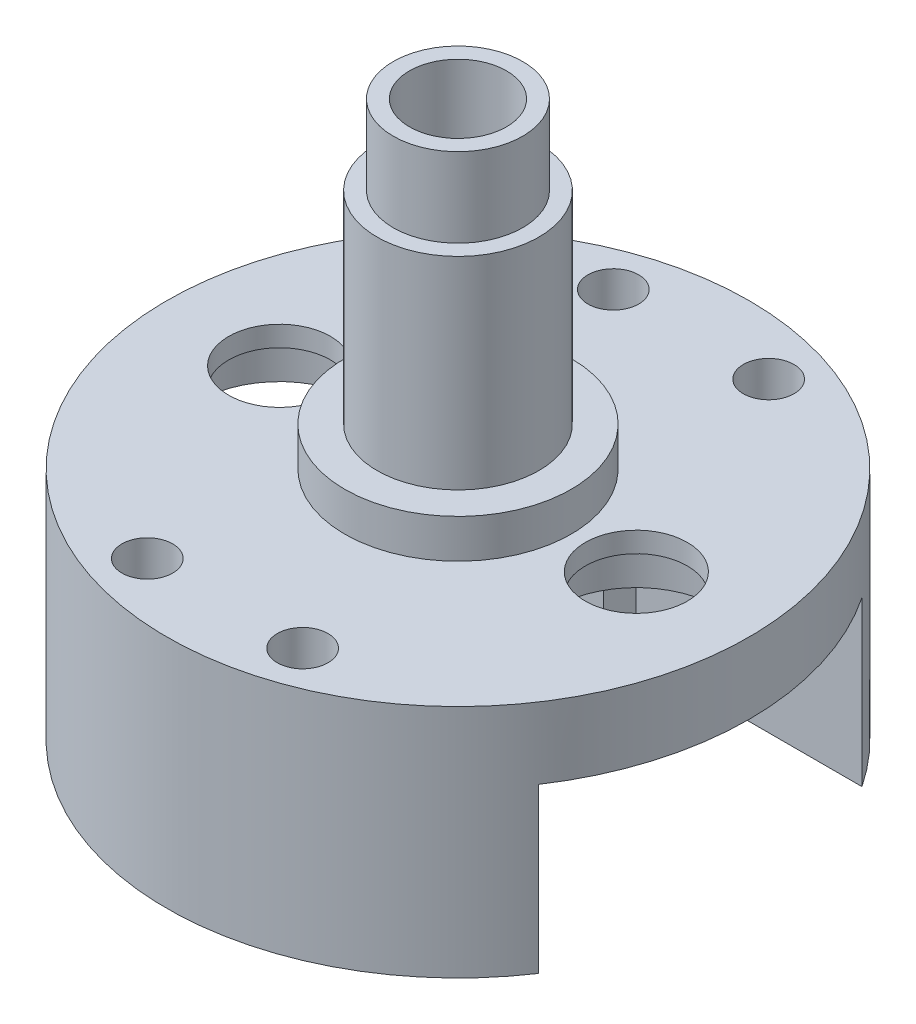
ISO-10303-21;
HEADER;
FILE_DESCRIPTION(('STEP AP214'),'2;1');
FILE_NAME('part.step','',(''),(''),'','','');
FILE_SCHEMA(('AUTOMOTIVE_DESIGN { 1 0 10303 214 1 1 1 1 }'));
ENDSEC;
DATA;
#1=APPLICATION_CONTEXT('core data for automotive mechanical design processes');
#2=APPLICATION_PROTOCOL_DEFINITION('international standard','automotive_design',2000,#1);
#3=PRODUCT_CONTEXT('',#1,'mechanical');
#4=PRODUCT('Part','Part','',(#3));
#5=PRODUCT_RELATED_PRODUCT_CATEGORY('part','',(#4));
#6=PRODUCT_DEFINITION_FORMATION('','',#4);
#7=PRODUCT_DEFINITION_CONTEXT('part definition',#1,'design');
#8=PRODUCT_DEFINITION('design','',#6,#7);
#9=PRODUCT_DEFINITION_SHAPE('','',#8);
#10=(LENGTH_UNIT() NAMED_UNIT(*) SI_UNIT(.MILLI.,.METRE.));
#11=(NAMED_UNIT(*) PLANE_ANGLE_UNIT() SI_UNIT($,.RADIAN.));
#12=(NAMED_UNIT(*) SI_UNIT($,.STERADIAN.) SOLID_ANGLE_UNIT());
#13=UNCERTAINTY_MEASURE_WITH_UNIT(LENGTH_MEASURE(1.E-05),#10,'distance_accuracy_value','');
#14=(GEOMETRIC_REPRESENTATION_CONTEXT(3) GLOBAL_UNCERTAINTY_ASSIGNED_CONTEXT((#13)) GLOBAL_UNIT_ASSIGNED_CONTEXT((#10,
#11,#12)) REPRESENTATION_CONTEXT('',''));
#15=CARTESIAN_POINT('',(0.,0.,0.));
#16=DIRECTION('',(0.,0.,1.));
#17=DIRECTION('',(1.,0.,0.));
#18=AXIS2_PLACEMENT_3D('',#15,#16,#17);
#19=CARTESIAN_POINT('',(0.,23.65375,0.));
#20=DIRECTION('',(0.,1.,0.));
#21=DIRECTION('',(0.,0.,1.));
#22=AXIS2_PLACEMENT_3D('',#19,#20,#21);
#23=PLANE('',#22);
#24=CARTESIAN_POINT('',(0.,23.65375,0.));
#25=DIRECTION('',(0.,1.,0.));
#26=DIRECTION('',(0.,0.,1.));
#27=AXIS2_PLACEMENT_3D('',#24,#25,#26);
#28=CIRCLE('',#27,7.9375);
#29=CARTESIAN_POINT('',(0.,23.65375,-7.9375));
#30=VERTEX_POINT('',#29);
#31=EDGE_CURVE('E272',#30,#30,#28,.T.);
#32=ORIENTED_EDGE('',*,*,#31,.T.);
#33=EDGE_LOOP('',(#32));
#34=FACE_BOUND('',#33,.T.);
#35=CARTESIAN_POINT('',(0.,23.65375,0.));
#36=DIRECTION('',(0.,1.,0.));
#37=DIRECTION('',(0.,0.,1.));
#38=AXIS2_PLACEMENT_3D('',#35,#36,#37);
#39=CIRCLE('',#38,6.35);
#40=CARTESIAN_POINT('',(0.,23.65375,6.35));
#41=VERTEX_POINT('',#40);
#42=EDGE_CURVE('E577',#41,#41,#39,.T.);
#43=ORIENTED_EDGE('',*,*,#42,.F.);
#44=EDGE_LOOP('',(#43));
#45=FACE_BOUND('',#44,.T.);
#46=ADVANCED_FACE('F41',(#34,#45),#23,.T.);
#47=CARTESIAN_POINT('',(0.,-7.,0.));
#48=DIRECTION('',(0.,1.,0.));
#49=DIRECTION('',(0.,0.,1.));
#50=AXIS2_PLACEMENT_3D('',#47,#48,#49);
#51=CYLINDRICAL_SURFACE('',#50,28.575);
#52=CARTESIAN_POINT('',(0.,0.,0.));
#53=DIRECTION('',(0.,-1.,0.));
#54=DIRECTION('',(0.,0.,-1.));
#55=AXIS2_PLACEMENT_3D('',#52,#53,#54);
#56=CIRCLE('',#55,28.575);
#57=CARTESIAN_POINT('',(0.,0.,-28.575));
#58=VERTEX_POINT('',#57);
#59=EDGE_CURVE('E301',#58,#58,#56,.T.);
#60=ORIENTED_EDGE('',*,*,#59,.T.);
#61=EDGE_LOOP('',(#60));
#62=FACE_BOUND('',#61,.T.);
#63=CARTESIAN_POINT('',(0.,-23.063999876,0.));
#64=DIRECTION('',(0.,-1.,0.));
#65=DIRECTION('',(0.,0.,-1.));
#66=AXIS2_PLACEMENT_3D('',#63,#64,#65);
#67=CIRCLE('',#66,28.575);
#68=CARTESIAN_POINT('',(1.5875,-23.063999876,-28.5308686995331));
#69=VERTEX_POINT('',#68);
#70=CARTESIAN_POINT('',(23.7595244060145,-23.063999876,-15.875));
#71=VERTEX_POINT('',#70);
#72=EDGE_CURVE('E316',#69,#71,#67,.T.);
#73=ORIENTED_EDGE('',*,*,#72,.F.);
#74=DIRECTION('',(0.,1.,0.));
#75=VECTOR('',#74,1.);
#76=CARTESIAN_POINT('',(1.5875,-7.,-28.5308686995331));
#77=LINE('',#76,#75);
#78=CARTESIAN_POINT('',(1.5875,-8.5875,-28.5308686995331));
#79=VERTEX_POINT('',#78);
#80=EDGE_CURVE('E145',#69,#79,#77,.T.);
#81=ORIENTED_EDGE('',*,*,#80,.T.);
#82=CARTESIAN_POINT('',(1.5875,-8.5875,-28.5308686995331));
#83=CARTESIAN_POINT('',(1.58749974451946,-8.54287386097159,-28.5308681095562));
#84=CARTESIAN_POINT('',(1.58561709384864,-8.49826913552358,-28.5309735349975));
#85=CARTESIAN_POINT('',(1.57810670264764,-8.40937952397936,-28.5313901712426));
#86=CARTESIAN_POINT('',(1.57247916280447,-8.36509462087254,-28.531701371019));
#87=CARTESIAN_POINT('',(1.55003331279288,-8.23327392438512,-28.5329329180939));
#88=CARTESIAN_POINT('',(1.52765162069218,-8.14662221965412,-28.5341512536931));
#89=CARTESIAN_POINT('',(1.4686791099605,-7.97831722788696,-28.5372470307653));
#90=CARTESIAN_POINT('',(1.43208208220718,-7.89666614314049,-28.5391247602207));
#91=CARTESIAN_POINT('',(1.34572456158475,-7.74066833680871,-28.5433269249275));
#92=CARTESIAN_POINT('',(1.29596634545697,-7.66632035491434,-28.5456512828981));
#93=CARTESIAN_POINT('',(1.18463872995349,-7.52695729549172,-28.5504878023659));
#94=CARTESIAN_POINT('',(1.12305776151971,-7.46195146950919,-28.5530001463337));
#95=CARTESIAN_POINT('',(0.98984761936737,-7.34318443070905,-28.5579281498262));
#96=CARTESIAN_POINT('',(0.918216917853672,-7.28942493069805,-28.5603437945787));
#97=CARTESIAN_POINT('',(0.766893508850195,-7.19465926742233,-28.5648074335915));
#98=CARTESIAN_POINT('',(0.687195951964639,-7.15366083655116,-28.5668552046274));
#99=CARTESIAN_POINT('',(0.522040362940325,-7.08563268377866,-28.5703502532702));
#100=CARTESIAN_POINT('',(0.436582736213694,-7.05860197994221,-28.5717975730875));
#101=CARTESIAN_POINT('',(0.262421149881926,-7.01929960774193,-28.5739274952282));
#102=CARTESIAN_POINT('',(0.173720604513397,-7.00701285282388,-28.5746108791898));
#103=CARTESIAN_POINT('',(-0.00448861961226308,-6.99750050703939,-28.5751385562652));
#104=CARTESIAN_POINT('',(-0.0939973107934277,-7.00027514811434,-28.5749828364568));
#105=CARTESIAN_POINT('',(-0.271174868478037,-7.02079487658822,-28.5738504787019));
#106=CARTESIAN_POINT('',(-0.358845673097291,-7.03852328683509,-28.5728747552666));
#107=CARTESIAN_POINT('',(-0.529964631146643,-7.08842139164104,-28.5702133328293));
#108=CARTESIAN_POINT('',(-0.613412782696599,-7.12059109263007,-28.5685276335111));
#109=CARTESIAN_POINT('',(-0.773773316923959,-7.19847828358874,-28.5646344944156));
#110=CARTESIAN_POINT('',(-0.850681872090433,-7.24420363816135,-28.5624267519148));
#111=CARTESIAN_POINT('',(-0.995734138889931,-7.34789626419317,-28.5577382331418));
#112=CARTESIAN_POINT('',(-1.06387818977172,-7.40586306159173,-28.5552574674445));
#113=CARTESIAN_POINT('',(-1.18955944189777,-7.53247785539499,-28.5502984695136));
#114=CARTESIAN_POINT('',(-1.24708361978504,-7.60113877855827,-28.5478202440485));
#115=CARTESIAN_POINT('',(-1.34980898824525,-7.7471774005003,-28.5431479452264));
#116=CARTESIAN_POINT('',(-1.39500631284098,-7.82455782318171,-28.5409539611269));
#117=CARTESIAN_POINT('',(-1.47179189570405,-7.98585687620663,-28.5370975827023));
#118=CARTESIAN_POINT('',(-1.50337135633481,-8.06977969196617,-28.5354355322039));
#119=CARTESIAN_POINT('',(-1.55194010309157,-8.24168284677174,-28.5328356169479));
#120=CARTESIAN_POINT('',(-1.56895160355785,-8.32965679168162,-28.5318966497985));
#121=CARTESIAN_POINT('',(-1.58147470152043,-8.44643747009319,-28.5312033671643));
#122=CARTESIAN_POINT('',(-1.58373536186221,-8.47462732301339,-28.5310779351323));
#123=CARTESIAN_POINT('',(-1.58674595407189,-8.53104094422383,-28.5309107108068));
#124=CARTESIAN_POINT('',(-1.5874983876154,-8.55926457852647,-28.5308687800118));
#125=CARTESIAN_POINT('',(-1.5875,-8.5875,-28.5308686995331));
#126=B_SPLINE_CURVE_WITH_KNOTS('',3,(#82,#83,#84,#85,#86,#87,#88,#89,#90,#91,#92,#93,#94,#95,
#96,#97,#98,#99,#100,#101,#102,#103,#104,#105,#106,#107,#108,#109,#110,#111,#112,#113,#114,#115,
#116,#117,#118,#119,#120,#121,#122,#123,#124,#125),.UNSPECIFIED.,.F.,.F.,(4,2,2,2,2,2,2,2,2,2,2,
2,2,2,2,2,2,2,2,2,2,4),(0.,0.133796078347074,0.267584987197385,0.534718763867588,
0.801969353458221,1.06917374182794,1.33664094599597,1.60414885560075,1.87181854378779,
2.13946941215955,2.40684617608626,2.67422705755392,2.94131013685757,3.20839333507925,
3.47563179160472,3.74285990098265,4.01041357161094,4.27805105682206,4.54586118751098,
4.81326220992297,4.89807564843998,4.98274829124183),.UNSPECIFIED.);
#127=CARTESIAN_POINT('',(-1.5875,-8.5875,-28.5308686995331));
#128=VERTEX_POINT('',#127);
#129=EDGE_CURVE('E118',#79,#128,#126,.T.);
#130=ORIENTED_EDGE('',*,*,#129,.T.);
#131=DIRECTION('',(0.,1.,0.));
#132=VECTOR('',#131,1.);
#133=CARTESIAN_POINT('',(-1.5875,-7.,-28.5308686995331));
#134=LINE('',#133,#132);
#135=CARTESIAN_POINT('',(-1.5875,-23.063999876,-28.5308686995331));
#136=VERTEX_POINT('',#135);
#137=EDGE_CURVE('E141',#136,#128,#134,.T.);
#138=ORIENTED_EDGE('',*,*,#137,.F.);
#139=CARTESIAN_POINT('',(-23.7595244060145,-23.063999876,-15.875));
#140=VERTEX_POINT('',#139);
#141=EDGE_CURVE('E310',#140,#136,#67,.T.);
#142=ORIENTED_EDGE('',*,*,#141,.F.);
#143=DIRECTION('',(0.,1.,0.));
#144=VECTOR('',#143,1.);
#145=CARTESIAN_POINT('',(-23.7595244060145,-23.063999876,-15.875));
#146=LINE('',#145,#144);
#147=CARTESIAN_POINT('',(-23.7595244060145,-7.,-15.875));
#148=VERTEX_POINT('',#147);
#149=EDGE_CURVE('E315',#140,#148,#146,.T.);
#150=ORIENTED_EDGE('',*,*,#149,.T.);
#151=CARTESIAN_POINT('',(0.,-7.,0.));
#152=DIRECTION('',(0.,-1.,0.));
#153=DIRECTION('',(0.,0.,-1.));
#154=AXIS2_PLACEMENT_3D('',#151,#152,#153);
#155=CIRCLE('',#154,28.575);
#156=CARTESIAN_POINT('',(-23.7595244060145,-7.,15.875));
#157=VERTEX_POINT('',#156);
#158=EDGE_CURVE('E292',#157,#148,#155,.T.);
#159=ORIENTED_EDGE('',*,*,#158,.F.);
#160=DIRECTION('',(0.,1.,0.));
#161=VECTOR('',#160,1.);
#162=CARTESIAN_POINT('',(-23.7595244060145,-23.063999876,15.875));
#163=LINE('',#162,#161);
#164=CARTESIAN_POINT('',(-23.7595244060145,-23.063999876,15.875));
#165=VERTEX_POINT('',#164);
#166=EDGE_CURVE('E321',#165,#157,#163,.T.);
#167=ORIENTED_EDGE('',*,*,#166,.F.);
#168=CARTESIAN_POINT('',(0.,-23.063999876,0.));
#169=DIRECTION('',(0.,-1.,0.));
#170=DIRECTION('',(0.,0.,-1.));
#171=AXIS2_PLACEMENT_3D('',#168,#169,#170);
#172=CIRCLE('',#171,28.575);
#173=CARTESIAN_POINT('',(23.7595244060145,-23.063999876,15.875));
#174=VERTEX_POINT('',#173);
#175=EDGE_CURVE('E381',#174,#165,#172,.T.);
#176=ORIENTED_EDGE('',*,*,#175,.F.);
#177=DIRECTION('',(0.,1.,0.));
#178=VECTOR('',#177,1.);
#179=CARTESIAN_POINT('',(23.7595244060145,-23.063999876,15.875));
#180=LINE('',#179,#178);
#181=CARTESIAN_POINT('',(23.7595244060145,-7.,15.875));
#182=VERTEX_POINT('',#181);
#183=EDGE_CURVE('E378',#174,#182,#180,.T.);
#184=ORIENTED_EDGE('',*,*,#183,.T.);
#185=CARTESIAN_POINT('',(23.7595244060145,-7.,-15.875));
#186=VERTEX_POINT('',#185);
#187=EDGE_CURVE('E66',#186,#182,#155,.T.);
#188=ORIENTED_EDGE('',*,*,#187,.F.);
#189=DIRECTION('',(0.,1.,0.));
#190=VECTOR('',#189,1.);
#191=CARTESIAN_POINT('',(23.7595244060145,-23.063999876,-15.875));
#192=LINE('',#191,#190);
#193=EDGE_CURVE('E323',#71,#186,#192,.T.);
#194=ORIENTED_EDGE('',*,*,#193,.F.);
#195=EDGE_LOOP('',(#73,#81,#130,#138,#142,#150,#159,#167,#176,#184,#188,#194));
#196=FACE_BOUND('',#195,.T.);
#197=ADVANCED_FACE('F155',(#62,#196),#51,.T.);
#198=CARTESIAN_POINT('',(0.,-23.063999876,-15.875));
#199=DIRECTION('',(0.,0.,1.));
#200=DIRECTION('',(1.,0.,0.));
#201=AXIS2_PLACEMENT_3D('',#198,#199,#200);
#202=PLANE('',#201);
#203=DIRECTION('',(1.,0.,0.));
#204=VECTOR('',#203,1.);
#205=CARTESIAN_POINT('',(0.,-23.063999876,-15.875));
#206=LINE('',#205,#204);
#207=CARTESIAN_POINT('',(-1.5875,-23.063999876,-15.875));
#208=VERTEX_POINT('',#207);
#209=EDGE_CURVE('E308',#140,#208,#206,.T.);
#210=ORIENTED_EDGE('',*,*,#209,.T.);
#211=DIRECTION('',(0.,1.,0.));
#212=VECTOR('',#211,1.);
#213=CARTESIAN_POINT('',(-1.5875,0.,-15.875));
#214=LINE('',#213,#212);
#215=CARTESIAN_POINT('',(-1.5875,-8.5875,-15.875));
#216=VERTEX_POINT('',#215);
#217=EDGE_CURVE('E58',#208,#216,#214,.T.);
#218=ORIENTED_EDGE('',*,*,#217,.T.);
#219=CARTESIAN_POINT('',(0.,-8.5875,-15.875));
#220=DIRECTION('',(0.,0.,1.));
#221=DIRECTION('',(1.,0.,0.));
#222=AXIS2_PLACEMENT_3D('',#219,#220,#221);
#223=CIRCLE('',#222,1.5875);
#224=CARTESIAN_POINT('',(0.,-7.,-15.875));
#225=VERTEX_POINT('',#224);
#226=EDGE_CURVE('E130',#225,#216,#223,.T.);
#227=ORIENTED_EDGE('',*,*,#226,.F.);
#228=DIRECTION('',(1.,0.,0.));
#229=VECTOR('',#228,1.);
#230=CARTESIAN_POINT('',(0.,-7.,-15.875));
#231=LINE('',#230,#229);
#232=EDGE_CURVE('E295',#148,#225,#231,.T.);
#233=ORIENTED_EDGE('',*,*,#232,.F.);
#234=ORIENTED_EDGE('',*,*,#149,.F.);
#235=EDGE_LOOP('',(#210,#218,#227,#233,#234));
#236=FACE_BOUND('',#235,.T.);
#237=ADVANCED_FACE('F199',(#236),#202,.T.);
#238=CARTESIAN_POINT('',(0.,-23.063999876,0.));
#239=DIRECTION('',(0.,-1.,0.));
#240=DIRECTION('',(0.,0.,-1.));
#241=AXIS2_PLACEMENT_3D('',#238,#239,#240);
#242=PLANE('',#241);
#243=CARTESIAN_POINT('',(-7.62,-23.063999876,-22.86));
#244=DIRECTION('',(0.,-1.,0.));
#245=DIRECTION('',(0.,0.,1.));
#246=AXIS2_PLACEMENT_3D('',#243,#244,#245);
#247=CIRCLE('',#246,2.4892);
#248=CARTESIAN_POINT('',(-7.62,-23.063999876,-20.3708));
#249=VERTEX_POINT('',#248);
#250=EDGE_CURVE('E404',#249,#249,#247,.T.);
#251=ORIENTED_EDGE('',*,*,#250,.F.);
#252=EDGE_LOOP('',(#251));
#253=FACE_BOUND('',#252,.T.);
#254=ORIENTED_EDGE('',*,*,#141,.T.);
#255=DIRECTION('',(0.,0.,1.));
#256=VECTOR('',#255,1.);
#257=CARTESIAN_POINT('',(-1.5875,-23.063999876,0.));
#258=LINE('',#257,#256);
#259=EDGE_CURVE('E51',#136,#208,#258,.T.);
#260=ORIENTED_EDGE('',*,*,#259,.T.);
#261=ORIENTED_EDGE('',*,*,#209,.F.);
#262=EDGE_LOOP('',(#254,#260,#261));
#263=FACE_BOUND('',#262,.T.);
#264=ADVANCED_FACE('F195',(#253,#263),#242,.T.);
#265=CARTESIAN_POINT('',(0.,-7.,0.));
#266=DIRECTION('',(0.,-1.,0.));
#267=DIRECTION('',(0.,0.,-1.));
#268=AXIS2_PLACEMENT_3D('',#265,#266,#267);
#269=PLANE('',#268);
#270=CARTESIAN_POINT('',(17.5,-7.,0.));
#271=DIRECTION('',(0.,-1.,0.));
#272=DIRECTION('',(0.,0.,-1.));
#273=AXIS2_PLACEMENT_3D('',#270,#271,#272);
#274=CIRCLE('',#273,8.);
#275=CARTESIAN_POINT('',(17.5,-7.,-8.));
#276=VERTEX_POINT('',#275);
#277=EDGE_CURVE('E329',#276,#276,#274,.T.);
#278=ORIENTED_EDGE('',*,*,#277,.F.);
#279=EDGE_LOOP('',(#278));
#280=FACE_BOUND('',#279,.T.);
#281=CARTESIAN_POINT('',(-17.5,-7.,0.));
#282=DIRECTION('',(0.,-1.,0.));
#283=DIRECTION('',(0.,0.,-1.));
#284=AXIS2_PLACEMENT_3D('',#281,#282,#283);
#285=CIRCLE('',#284,8.);
#286=CARTESIAN_POINT('',(-17.5,-7.,-8.));
#287=VERTEX_POINT('',#286);
#288=EDGE_CURVE('E288',#287,#287,#285,.T.);
#289=ORIENTED_EDGE('',*,*,#288,.F.);
#290=EDGE_LOOP('',(#289));
#291=FACE_BOUND('',#290,.T.);
#292=CARTESIAN_POINT('',(0.,-7.,0.));
#293=DIRECTION('',(0.,-1.,0.));
#294=DIRECTION('',(0.,0.,-1.));
#295=AXIS2_PLACEMENT_3D('',#292,#293,#294);
#296=CIRCLE('',#295,7.9375);
#297=CARTESIAN_POINT('',(0.,-7.,-7.9375));
#298=VERTEX_POINT('',#297);
#299=EDGE_CURVE('E341',#298,#298,#296,.T.);
#300=ORIENTED_EDGE('',*,*,#299,.F.);
#301=EDGE_LOOP('',(#300));
#302=FACE_BOUND('',#301,.T.);
#303=ORIENTED_EDGE('',*,*,#187,.T.);
#304=DIRECTION('',(1.,0.,0.));
#305=VECTOR('',#304,1.);
#306=CARTESIAN_POINT('',(0.,-7.,15.875));
#307=LINE('',#306,#305);
#308=EDGE_CURVE('E386',#157,#182,#307,.T.);
#309=ORIENTED_EDGE('',*,*,#308,.F.);
#310=ORIENTED_EDGE('',*,*,#158,.T.);
#311=ORIENTED_EDGE('',*,*,#232,.T.);
#312=EDGE_CURVE('E45',#225,#186,#231,.T.);
#313=ORIENTED_EDGE('',*,*,#312,.T.);
#314=EDGE_LOOP('',(#303,#309,#310,#311,#313));
#315=FACE_BOUND('',#314,.T.);
#316=ADVANCED_FACE('F224',(#280,#291,#302,#315),#269,.T.);
#317=CARTESIAN_POINT('',(17.5,-7.,0.));
#318=DIRECTION('',(0.,1.,0.));
#319=DIRECTION('',(0.,0.,1.));
#320=AXIS2_PLACEMENT_3D('',#317,#318,#319);
#321=CYLINDRICAL_SURFACE('',#320,5.);
#322=CARTESIAN_POINT('',(17.5,0.,0.));
#323=DIRECTION('',(0.,-1.,0.));
#324=DIRECTION('',(0.,0.,-1.));
#325=AXIS2_PLACEMENT_3D('',#322,#323,#324);
#326=CIRCLE('',#325,5.);
#327=CARTESIAN_POINT('',(17.5,0.,-5.));
#328=VERTEX_POINT('',#327);
#329=EDGE_CURVE('E338',#328,#328,#326,.T.);
#330=ORIENTED_EDGE('',*,*,#329,.F.);
#331=EDGE_LOOP('',(#330));
#332=FACE_BOUND('',#331,.T.);
#333=CARTESIAN_POINT('',(17.5,-2.,0.));
#334=DIRECTION('',(0.,-1.,0.));
#335=DIRECTION('',(0.,0.,-1.));
#336=AXIS2_PLACEMENT_3D('',#333,#334,#335);
#337=CIRCLE('',#336,5.);
#338=CARTESIAN_POINT('',(17.5,-2.,-5.));
#339=VERTEX_POINT('',#338);
#340=EDGE_CURVE('E285',#339,#339,#337,.T.);
#341=ORIENTED_EDGE('',*,*,#340,.T.);
#342=EDGE_LOOP('',(#341));
#343=FACE_BOUND('',#342,.T.);
#344=ADVANCED_FACE('F220',(#332,#343),#321,.F.);
#345=CARTESIAN_POINT('',(-17.5,-7.,0.));
#346=DIRECTION('',(0.,1.,0.));
#347=DIRECTION('',(0.,0.,1.));
#348=AXIS2_PLACEMENT_3D('',#345,#346,#347);
#349=CYLINDRICAL_SURFACE('',#348,5.);
#350=CARTESIAN_POINT('',(-17.5,0.,0.));
#351=DIRECTION('',(0.,-1.,0.));
#352=DIRECTION('',(0.,0.,-1.));
#353=AXIS2_PLACEMENT_3D('',#350,#351,#352);
#354=CIRCLE('',#353,5.);
#355=CARTESIAN_POINT('',(-17.5,0.,-5.));
#356=VERTEX_POINT('',#355);
#357=EDGE_CURVE('E283',#356,#356,#354,.T.);
#358=ORIENTED_EDGE('',*,*,#357,.F.);
#359=EDGE_LOOP('',(#358));
#360=FACE_BOUND('',#359,.T.);
#361=CARTESIAN_POINT('',(-17.5,-2.,0.));
#362=DIRECTION('',(0.,-1.,0.));
#363=DIRECTION('',(0.,0.,-1.));
#364=AXIS2_PLACEMENT_3D('',#361,#362,#363);
#365=CIRCLE('',#364,5.);
#366=CARTESIAN_POINT('',(-17.5,-2.,-5.));
#367=VERTEX_POINT('',#366);
#368=EDGE_CURVE('E280',#367,#367,#365,.T.);
#369=ORIENTED_EDGE('',*,*,#368,.T.);
#370=EDGE_LOOP('',(#369));
#371=FACE_BOUND('',#370,.T.);
#372=ADVANCED_FACE('F216',(#360,#371),#349,.F.);
#373=CARTESIAN_POINT('',(0.,3.81,0.));
#374=DIRECTION('',(0.,1.,0.));
#375=DIRECTION('',(0.,0.,1.));
#376=AXIS2_PLACEMENT_3D('',#373,#374,#375);
#377=PLANE('',#376);
#378=CARTESIAN_POINT('',(0.,3.81,0.));
#379=DIRECTION('',(0.,1.,0.));
#380=DIRECTION('',(0.,0.,1.));
#381=AXIS2_PLACEMENT_3D('',#378,#379,#380);
#382=CIRCLE('',#381,11.1125);
#383=CARTESIAN_POINT('',(0.,3.81,-11.1125));
#384=VERTEX_POINT('',#383);
#385=EDGE_CURVE('E271',#384,#384,#382,.T.);
#386=ORIENTED_EDGE('',*,*,#385,.T.);
#387=EDGE_LOOP('',(#386));
#388=FACE_BOUND('',#387,.T.);
#389=CARTESIAN_POINT('',(0.,3.81,0.));
#390=DIRECTION('',(0.,1.,0.));
#391=DIRECTION('',(0.,0.,1.));
#392=AXIS2_PLACEMENT_3D('',#389,#390,#391);
#393=CIRCLE('',#392,7.9375);
#394=CARTESIAN_POINT('',(0.,3.81,-7.9375));
#395=VERTEX_POINT('',#394);
#396=EDGE_CURVE('E276',#395,#395,#393,.T.);
#397=ORIENTED_EDGE('',*,*,#396,.F.);
#398=EDGE_LOOP('',(#397));
#399=FACE_BOUND('',#398,.T.);
#400=ADVANCED_FACE('F219',(#388,#399),#377,.T.);
#401=CARTESIAN_POINT('',(0.,0.,0.));
#402=DIRECTION('',(0.,1.,0.));
#403=DIRECTION('',(0.,0.,1.));
#404=AXIS2_PLACEMENT_3D('',#401,#402,#403);
#405=PLANE('',#404);
#406=CARTESIAN_POINT('',(0.,0.,0.));
#407=DIRECTION('',(0.,-1.,0.));
#408=DIRECTION('',(0.,0.,-1.));
#409=AXIS2_PLACEMENT_3D('',#406,#407,#408);
#410=CIRCLE('',#409,7.9375);
#411=CARTESIAN_POINT('',(0.,0.,-7.9375));
#412=VERTEX_POINT('',#411);
#413=EDGE_CURVE('E267',#412,#412,#410,.T.);
#414=ORIENTED_EDGE('',*,*,#413,.T.);
#415=EDGE_LOOP('',(#414));
#416=FACE_BOUND('',#415,.T.);
#417=CARTESIAN_POINT('',(0.,0.,0.));
#418=DIRECTION('',(0.,1.,0.));
#419=DIRECTION('',(0.,0.,1.));
#420=AXIS2_PLACEMENT_3D('',#417,#418,#419);
#421=CIRCLE('',#420,4.7625);
#422=CARTESIAN_POINT('',(0.,0.,-4.7625));
#423=VERTEX_POINT('',#422);
#424=EDGE_CURVE('E270',#423,#423,#421,.T.);
#425=ORIENTED_EDGE('',*,*,#424,.T.);
#426=EDGE_LOOP('',(#425));
#427=FACE_BOUND('',#426,.T.);
#428=ADVANCED_FACE('F256',(#416,#427),#405,.F.);
#429=CARTESIAN_POINT('',(0.,3.81,0.));
#430=DIRECTION('',(0.,-1.,0.));
#431=DIRECTION('',(0.,0.,-1.));
#432=AXIS2_PLACEMENT_3D('',#429,#430,#431);
#433=CYLINDRICAL_SURFACE('',#432,11.1125);
#434=CARTESIAN_POINT('',(0.,0.,0.));
#435=DIRECTION('',(0.,-1.,0.));
#436=DIRECTION('',(0.,0.,-1.));
#437=AXIS2_PLACEMENT_3D('',#434,#435,#436);
#438=CIRCLE('',#437,11.1125);
#439=CARTESIAN_POINT('',(0.,0.,-11.1125));
#440=VERTEX_POINT('',#439);
#441=EDGE_CURVE('E291',#440,#440,#438,.T.);
#442=CARTESIAN_POINT('',(0.,3.81,-11.1125));
#443=CARTESIAN_POINT('',(0.,3.7703125,-11.1125));
#444=CARTESIAN_POINT('',(0.,3.730625,-11.1125));
#445=CARTESIAN_POINT('',(0.,3.65125,-11.1125));
#446=CARTESIAN_POINT('',(0.,3.6115625,-11.1125));
#447=CARTESIAN_POINT('',(0.,3.5321875,-11.1125));
#448=CARTESIAN_POINT('',(0.,3.4925,-11.1125));
#449=CARTESIAN_POINT('',(0.,3.413125,-11.1125));
#450=CARTESIAN_POINT('',(0.,3.3734375,-11.1125));
#451=CARTESIAN_POINT('',(0.,3.2940625,-11.1125));
#452=CARTESIAN_POINT('',(0.,3.254375,-11.1125));
#453=CARTESIAN_POINT('',(0.,3.175,-11.1125));
#454=CARTESIAN_POINT('',(0.,3.1353125,-11.1125));
#455=CARTESIAN_POINT('',(0.,3.0559375,-11.1125));
#456=CARTESIAN_POINT('',(0.,3.01625,-11.1125));
#457=CARTESIAN_POINT('',(0.,2.936875,-11.1125));
#458=CARTESIAN_POINT('',(0.,2.8971875,-11.1125));
#459=CARTESIAN_POINT('',(0.,2.8178125,-11.1125));
#460=CARTESIAN_POINT('',(0.,2.778125,-11.1125));
#461=CARTESIAN_POINT('',(0.,2.69875,-11.1125));
#462=CARTESIAN_POINT('',(0.,2.6590625,-11.1125));
#463=CARTESIAN_POINT('',(0.,2.5796875,-11.1125));
#464=CARTESIAN_POINT('',(0.,2.54,-11.1125));
#465=CARTESIAN_POINT('',(0.,2.460625,-11.1125));
#466=CARTESIAN_POINT('',(0.,2.4209375,-11.1125));
#467=CARTESIAN_POINT('',(0.,2.3415625,-11.1125));
#468=CARTESIAN_POINT('',(0.,2.301875,-11.1125));
#469=CARTESIAN_POINT('',(0.,2.2225,-11.1125));
#470=CARTESIAN_POINT('',(0.,2.1828125,-11.1125));
#471=CARTESIAN_POINT('',(0.,2.1034375,-11.1125));
#472=CARTESIAN_POINT('',(0.,2.06375,-11.1125));
#473=CARTESIAN_POINT('',(0.,1.984375,-11.1125));
#474=CARTESIAN_POINT('',(0.,1.9446875,-11.1125));
#475=CARTESIAN_POINT('',(0.,1.8653125,-11.1125));
#476=CARTESIAN_POINT('',(0.,1.825625,-11.1125));
#477=CARTESIAN_POINT('',(0.,1.74625,-11.1125));
#478=CARTESIAN_POINT('',(0.,1.7065625,-11.1125));
#479=CARTESIAN_POINT('',(0.,1.6271875,-11.1125));
#480=CARTESIAN_POINT('',(0.,1.5875,-11.1125));
#481=CARTESIAN_POINT('',(0.,1.508125,-11.1125));
#482=CARTESIAN_POINT('',(0.,1.4684375,-11.1125));
#483=CARTESIAN_POINT('',(0.,1.3890625,-11.1125));
#484=CARTESIAN_POINT('',(0.,1.349375,-11.1125));
#485=CARTESIAN_POINT('',(0.,1.27,-11.1125));
#486=CARTESIAN_POINT('',(0.,1.2303125,-11.1125));
#487=CARTESIAN_POINT('',(0.,1.1509375,-11.1125));
#488=CARTESIAN_POINT('',(0.,1.11125,-11.1125));
#489=CARTESIAN_POINT('',(0.,1.031875,-11.1125));
#490=CARTESIAN_POINT('',(0.,0.9921875,-11.1125));
#491=CARTESIAN_POINT('',(0.,0.9128125,-11.1125));
#492=CARTESIAN_POINT('',(0.,0.873125,-11.1125));
#493=CARTESIAN_POINT('',(0.,0.79375,-11.1125));
#494=CARTESIAN_POINT('',(0.,0.7540625,-11.1125));
#495=CARTESIAN_POINT('',(0.,0.6746875,-11.1125));
#496=CARTESIAN_POINT('',(0.,0.635,-11.1125));
#497=CARTESIAN_POINT('',(0.,0.555625,-11.1125));
#498=CARTESIAN_POINT('',(0.,0.5159375,-11.1125));
#499=CARTESIAN_POINT('',(0.,0.4365625,-11.1125));
#500=CARTESIAN_POINT('',(0.,0.396875,-11.1125));
#501=CARTESIAN_POINT('',(0.,0.3175,-11.1125));
#502=CARTESIAN_POINT('',(0.,0.2778125,-11.1125));
#503=CARTESIAN_POINT('',(0.,0.1984375,-11.1125));
#504=CARTESIAN_POINT('',(0.,0.15875,-11.1125));
#505=CARTESIAN_POINT('',(0.,0.0793749999999999,-11.1125));
#506=CARTESIAN_POINT('',(0.,0.0396874999999999,-11.1125));
#507=CARTESIAN_POINT('',(0.,0.,-11.1125));
#508=B_SPLINE_CURVE_WITH_KNOTS('',3,(#442,#443,#444,#445,#446,#447,#448,#449,#450,#451,#452,
#453,#454,#455,#456,#457,#458,#459,#460,#461,#462,#463,#464,#465,#466,#467,#468,#469,#470,#471,
#472,#473,#474,#475,#476,#477,#478,#479,#480,#481,#482,#483,#484,#485,#486,#487,#488,#489,#490,
#491,#492,#493,#494,#495,#496,#497,#498,#499,#500,#501,#502,#503,#504,#505,#506,#507),
.UNSPECIFIED.,.F.,.F.,(4,2,2,2,2,2,2,2,2,2,2,2,2,2,2,2,2,2,2,2,2,2,2,2,2,2,2,2,2,2,2,2,4),(0.,
0.1190625,0.238125,0.3571875,0.47625,0.5953125,0.714375,0.8334375,0.9525,1.0715625,1.190625,
1.3096875,1.42875,1.5478125,1.666875,1.7859375,1.905,2.0240625,2.143125,2.2621875,2.38125,
2.5003125,2.619375,2.7384375,2.8575,2.9765625,3.095625,3.2146875,3.33375,3.4528125,3.571875,
3.6909375,3.81),.UNSPECIFIED.);
#509=EDGE_CURVE('BSEAM43',#384,#440,#508,.T.);
#510=ORIENTED_EDGE('',*,*,#385,.F.);
#511=ORIENTED_EDGE('',*,*,#441,.F.);
#512=ORIENTED_EDGE('',*,*,#509,.T.);
#513=ORIENTED_EDGE('',*,*,#509,.F.);
#514=EDGE_LOOP('',(#510,#512,#511,#513));
#515=FACE_BOUND('',#514,.T.);
#516=ADVANCED_FACE('F43',(#515),#433,.T.);
#517=CARTESIAN_POINT('',(0.,3.81,0.));
#518=DIRECTION('',(0.,-1.,0.));
#519=DIRECTION('',(0.,0.,-1.));
#520=AXIS2_PLACEMENT_3D('',#517,#518,#519);
#521=CYLINDRICAL_SURFACE('',#520,4.7625);
#522=CARTESIAN_POINT('',(0.,31.4325,0.));
#523=DIRECTION('',(0.,1.,0.));
#524=DIRECTION('',(0.,0.,1.));
#525=AXIS2_PLACEMENT_3D('',#522,#523,#524);
#526=CIRCLE('',#525,4.7625);
#527=CARTESIAN_POINT('',(0.,31.4325,-4.7625));
#528=VERTEX_POINT('',#527);
#529=EDGE_CURVE('E578',#528,#528,#526,.T.);
#530=CARTESIAN_POINT('',(0.,0.,-4.7625));
#531=CARTESIAN_POINT('',(0.,0.327421875,-4.7625));
#532=CARTESIAN_POINT('',(0.,0.65484375,-4.7625));
#533=CARTESIAN_POINT('',(0.,1.3096875,-4.7625));
#534=CARTESIAN_POINT('',(0.,1.637109375,-4.7625));
#535=CARTESIAN_POINT('',(0.,2.291953125,-4.7625));
#536=CARTESIAN_POINT('',(0.,2.619375,-4.7625));
#537=CARTESIAN_POINT('',(0.,3.27421875,-4.7625));
#538=CARTESIAN_POINT('',(0.,3.601640625,-4.7625));
#539=CARTESIAN_POINT('',(0.,4.256484375,-4.7625));
#540=CARTESIAN_POINT('',(0.,4.58390625,-4.7625));
#541=CARTESIAN_POINT('',(0.,5.23875,-4.7625));
#542=CARTESIAN_POINT('',(0.,5.566171875,-4.7625));
#543=CARTESIAN_POINT('',(0.,6.221015625,-4.7625));
#544=CARTESIAN_POINT('',(0.,6.5484375,-4.7625));
#545=CARTESIAN_POINT('',(0.,7.20328125,-4.7625));
#546=CARTESIAN_POINT('',(0.,7.530703125,-4.7625));
#547=CARTESIAN_POINT('',(0.,8.185546875,-4.7625));
#548=CARTESIAN_POINT('',(0.,8.51296875,-4.7625));
#549=CARTESIAN_POINT('',(0.,9.1678125,-4.7625));
#550=CARTESIAN_POINT('',(0.,9.495234375,-4.7625));
#551=CARTESIAN_POINT('',(0.,10.150078125,-4.7625));
#552=CARTESIAN_POINT('',(0.,10.4775,-4.7625));
#553=CARTESIAN_POINT('',(0.,11.13234375,-4.7625));
#554=CARTESIAN_POINT('',(0.,11.459765625,-4.7625));
#555=CARTESIAN_POINT('',(0.,12.114609375,-4.7625));
#556=CARTESIAN_POINT('',(0.,12.44203125,-4.7625));
#557=CARTESIAN_POINT('',(0.,13.096875,-4.7625));
#558=CARTESIAN_POINT('',(0.,13.424296875,-4.7625));
#559=CARTESIAN_POINT('',(0.,14.079140625,-4.7625));
#560=CARTESIAN_POINT('',(0.,14.4065625,-4.7625));
#561=CARTESIAN_POINT('',(0.,15.06140625,-4.7625));
#562=CARTESIAN_POINT('',(0.,15.388828125,-4.7625));
#563=CARTESIAN_POINT('',(0.,16.043671875,-4.7625));
#564=CARTESIAN_POINT('',(0.,16.37109375,-4.7625));
#565=CARTESIAN_POINT('',(0.,17.0259375,-4.7625));
#566=CARTESIAN_POINT('',(0.,17.353359375,-4.7625));
#567=CARTESIAN_POINT('',(0.,18.008203125,-4.7625));
#568=CARTESIAN_POINT('',(0.,18.335625,-4.7625));
#569=CARTESIAN_POINT('',(0.,18.99046875,-4.7625));
#570=CARTESIAN_POINT('',(0.,19.317890625,-4.7625));
#571=CARTESIAN_POINT('',(0.,19.972734375,-4.7625));
#572=CARTESIAN_POINT('',(0.,20.30015625,-4.7625));
#573=CARTESIAN_POINT('',(0.,20.955,-4.7625));
#574=CARTESIAN_POINT('',(0.,21.282421875,-4.7625));
#575=CARTESIAN_POINT('',(0.,21.937265625,-4.7625));
#576=CARTESIAN_POINT('',(0.,22.2646875,-4.7625));
#577=CARTESIAN_POINT('',(0.,22.91953125,-4.7625));
#578=CARTESIAN_POINT('',(0.,23.246953125,-4.7625));
#579=CARTESIAN_POINT('',(0.,23.901796875,-4.7625));
#580=CARTESIAN_POINT('',(0.,24.22921875,-4.7625));
#581=CARTESIAN_POINT('',(0.,24.8840625,-4.7625));
#582=CARTESIAN_POINT('',(0.,25.211484375,-4.7625));
#583=CARTESIAN_POINT('',(0.,25.866328125,-4.7625));
#584=CARTESIAN_POINT('',(0.,26.19375,-4.7625));
#585=CARTESIAN_POINT('',(0.,26.84859375,-4.7625));
#586=CARTESIAN_POINT('',(0.,27.176015625,-4.7625));
#587=CARTESIAN_POINT('',(0.,27.830859375,-4.7625));
#588=CARTESIAN_POINT('',(0.,28.15828125,-4.7625));
#589=CARTESIAN_POINT('',(0.,28.813125,-4.7625));
#590=CARTESIAN_POINT('',(0.,29.140546875,-4.7625));
#591=CARTESIAN_POINT('',(0.,29.795390625,-4.7625));
#592=CARTESIAN_POINT('',(0.,30.1228125,-4.7625));
#593=CARTESIAN_POINT('',(0.,30.77765625,-4.7625));
#594=CARTESIAN_POINT('',(0.,31.105078125,-4.7625));
#595=CARTESIAN_POINT('',(0.,31.4325,-4.7625));
#596=B_SPLINE_CURVE_WITH_KNOTS('',3,(#530,#531,#532,#533,#534,#535,#536,#537,#538,#539,#540,
#541,#542,#543,#544,#545,#546,#547,#548,#549,#550,#551,#552,#553,#554,#555,#556,#557,#558,#559,
#560,#561,#562,#563,#564,#565,#566,#567,#568,#569,#570,#571,#572,#573,#574,#575,#576,#577,#578,
#579,#580,#581,#582,#583,#584,#585,#586,#587,#588,#589,#590,#591,#592,#593,#594,#595),
.UNSPECIFIED.,.F.,.F.,(4,2,2,2,2,2,2,2,2,2,2,2,2,2,2,2,2,2,2,2,2,2,2,2,2,2,2,2,2,2,2,2,4),(0.,
0.982265625,1.96453125,2.946796875,3.9290625,4.911328125,5.89359375,6.875859375,7.858125,
8.840390625,9.82265625,10.804921875,11.7871875,12.769453125,13.75171875,14.733984375,15.71625,
16.698515625,17.68078125,18.663046875,19.6453125,20.627578125,21.60984375,22.592109375,
23.574375,24.556640625,25.53890625,26.521171875,27.5034375,28.485703125,29.46796875,
30.450234375,31.4325),.UNSPECIFIED.);
#597=EDGE_CURVE('BSEAM238',#423,#528,#596,.T.);
#598=ORIENTED_EDGE('',*,*,#424,.F.);
#599=ORIENTED_EDGE('',*,*,#529,.T.);
#600=ORIENTED_EDGE('',*,*,#597,.T.);
#601=ORIENTED_EDGE('',*,*,#597,.F.);
#602=EDGE_LOOP('',(#598,#600,#599,#601));
#603=FACE_BOUND('',#602,.T.);
#604=ADVANCED_FACE('F238',(#603),#521,.F.);
#605=CARTESIAN_POINT('',(0.,23.65375,0.));
#606=DIRECTION('',(0.,-1.,0.));
#607=DIRECTION('',(0.,0.,-1.));
#608=AXIS2_PLACEMENT_3D('',#605,#606,#607);
#609=CYLINDRICAL_SURFACE('',#608,7.9375);
#610=CARTESIAN_POINT('',(0.,23.65375,-7.9375));
#611=CARTESIAN_POINT('',(0.,23.4470442708333,-7.9375));
#612=CARTESIAN_POINT('',(0.,23.2403385416667,-7.9375));
#613=CARTESIAN_POINT('',(0.,22.8269270833333,-7.9375));
#614=CARTESIAN_POINT('',(0.,22.6202213541667,-7.9375));
#615=CARTESIAN_POINT('',(0.,22.2068098958333,-7.9375));
#616=CARTESIAN_POINT('',(0.,22.0001041666667,-7.9375));
#617=CARTESIAN_POINT('',(0.,21.5866927083333,-7.9375));
#618=CARTESIAN_POINT('',(0.,21.3799869791667,-7.9375));
#619=CARTESIAN_POINT('',(0.,20.9665755208333,-7.9375));
#620=CARTESIAN_POINT('',(0.,20.7598697916667,-7.9375));
#621=CARTESIAN_POINT('',(0.,20.3464583333333,-7.9375));
#622=CARTESIAN_POINT('',(0.,20.1397526041667,-7.9375));
#623=CARTESIAN_POINT('',(0.,19.7263411458333,-7.9375));
#624=CARTESIAN_POINT('',(0.,19.5196354166667,-7.9375));
#625=CARTESIAN_POINT('',(0.,19.1062239583333,-7.9375));
#626=CARTESIAN_POINT('',(0.,18.8995182291667,-7.9375));
#627=CARTESIAN_POINT('',(0.,18.4861067708333,-7.9375));
#628=CARTESIAN_POINT('',(0.,18.2794010416667,-7.9375));
#629=CARTESIAN_POINT('',(0.,17.8659895833333,-7.9375));
#630=CARTESIAN_POINT('',(0.,17.6592838541667,-7.9375));
#631=CARTESIAN_POINT('',(0.,17.2458723958333,-7.9375));
#632=CARTESIAN_POINT('',(0.,17.0391666666667,-7.9375));
#633=CARTESIAN_POINT('',(0.,16.6257552083333,-7.9375));
#634=CARTESIAN_POINT('',(0.,16.4190494791667,-7.9375));
#635=CARTESIAN_POINT('',(0.,16.0056380208333,-7.9375));
#636=CARTESIAN_POINT('',(0.,15.7989322916667,-7.9375));
#637=CARTESIAN_POINT('',(0.,15.3855208333333,-7.9375));
#638=CARTESIAN_POINT('',(0.,15.1788151041667,-7.9375));
#639=CARTESIAN_POINT('',(0.,14.7654036458333,-7.9375));
#640=CARTESIAN_POINT('',(0.,14.5586979166667,-7.9375));
#641=CARTESIAN_POINT('',(0.,14.1452864583333,-7.9375));
#642=CARTESIAN_POINT('',(0.,13.9385807291667,-7.9375));
#643=CARTESIAN_POINT('',(0.,13.5251692708333,-7.9375));
#644=CARTESIAN_POINT('',(0.,13.3184635416667,-7.9375));
#645=CARTESIAN_POINT('',(0.,12.9050520833333,-7.9375));
#646=CARTESIAN_POINT('',(0.,12.6983463541667,-7.9375));
#647=CARTESIAN_POINT('',(0.,12.2849348958333,-7.9375));
#648=CARTESIAN_POINT('',(0.,12.0782291666667,-7.9375));
#649=CARTESIAN_POINT('',(0.,11.6648177083333,-7.9375));
#650=CARTESIAN_POINT('',(0.,11.4581119791667,-7.9375));
#651=CARTESIAN_POINT('',(0.,11.0447005208333,-7.9375));
#652=CARTESIAN_POINT('',(0.,10.8379947916667,-7.9375));
#653=CARTESIAN_POINT('',(0.,10.4245833333333,-7.9375));
#654=CARTESIAN_POINT('',(0.,10.2178776041667,-7.9375));
#655=CARTESIAN_POINT('',(0.,9.80446614583333,-7.9375));
#656=CARTESIAN_POINT('',(0.,9.59776041666666,-7.9375));
#657=CARTESIAN_POINT('',(0.,9.18434895833333,-7.9375));
#658=CARTESIAN_POINT('',(0.,8.97764322916666,-7.9375));
#659=CARTESIAN_POINT('',(0.,8.56423177083333,-7.9375));
#660=CARTESIAN_POINT('',(0.,8.35752604166666,-7.9375));
#661=CARTESIAN_POINT('',(0.,7.94411458333333,-7.9375));
#662=CARTESIAN_POINT('',(0.,7.73740885416666,-7.9375));
#663=CARTESIAN_POINT('',(0.,7.32399739583333,-7.9375));
#664=CARTESIAN_POINT('',(0.,7.11729166666666,-7.9375));
#665=CARTESIAN_POINT('',(0.,6.70388020833333,-7.9375));
#666=CARTESIAN_POINT('',(0.,6.49717447916666,-7.9375));
#667=CARTESIAN_POINT('',(0.,6.08376302083333,-7.9375));
#668=CARTESIAN_POINT('',(0.,5.87705729166666,-7.9375));
#669=CARTESIAN_POINT('',(0.,5.46364583333333,-7.9375));
#670=CARTESIAN_POINT('',(0.,5.25694010416666,-7.9375));
#671=CARTESIAN_POINT('',(0.,4.84352864583333,-7.9375));
#672=CARTESIAN_POINT('',(0.,4.63682291666666,-7.9375));
#673=CARTESIAN_POINT('',(0.,4.22341145833333,-7.9375));
#674=CARTESIAN_POINT('',(0.,4.01670572916666,-7.9375));
#675=CARTESIAN_POINT('',(0.,3.81,-7.9375));
#676=B_SPLINE_CURVE_WITH_KNOTS('',3,(#610,#611,#612,#613,#614,#615,#616,#617,#618,#619,#620,
#621,#622,#623,#624,#625,#626,#627,#628,#629,#630,#631,#632,#633,#634,#635,#636,#637,#638,#639,
#640,#641,#642,#643,#644,#645,#646,#647,#648,#649,#650,#651,#652,#653,#654,#655,#656,#657,#658,
#659,#660,#661,#662,#663,#664,#665,#666,#667,#668,#669,#670,#671,#672,#673,#674,#675),
.UNSPECIFIED.,.F.,.F.,(4,2,2,2,2,2,2,2,2,2,2,2,2,2,2,2,2,2,2,2,2,2,2,2,2,2,2,2,2,2,2,2,4),(0.,
0.620117187500002,1.240234375,1.8603515625,2.48046875,3.1005859375,3.720703125,4.3408203125,
4.9609375,5.5810546875,6.201171875,6.8212890625,7.44140625,8.0615234375,8.681640625,
9.3017578125,9.921875,10.5419921875,11.162109375,11.7822265625,12.40234375,13.0224609375,
13.642578125,14.2626953125,14.8828125,15.5029296875,16.123046875,16.7431640625,17.36328125,
17.9833984375,18.603515625,19.2236328125,19.84375),.UNSPECIFIED.);
#677=EDGE_CURVE('BSEAM233',#30,#395,#676,.T.);
#678=ORIENTED_EDGE('',*,*,#31,.F.);
#679=ORIENTED_EDGE('',*,*,#396,.T.);
#680=ORIENTED_EDGE('',*,*,#677,.T.);
#681=ORIENTED_EDGE('',*,*,#677,.F.);
#682=EDGE_LOOP('',(#678,#680,#679,#681));
#683=FACE_BOUND('',#682,.T.);
#684=ADVANCED_FACE('F233',(#683),#609,.T.);
#685=CARTESIAN_POINT('',(0.,0.,0.));
#686=DIRECTION('',(0.,-1.,0.));
#687=DIRECTION('',(0.,0.,-1.));
#688=AXIS2_PLACEMENT_3D('',#685,#686,#687);
#689=PLANE('',#688);
#690=CARTESIAN_POINT('',(7.62,0.,-22.86));
#691=DIRECTION('',(0.,-1.,0.));
#692=DIRECTION('',(0.,0.,-1.));
#693=AXIS2_PLACEMENT_3D('',#690,#691,#692);
#694=CIRCLE('',#693,2.4892);
#695=CARTESIAN_POINT('',(7.62,0.,-25.3492));
#696=VERTEX_POINT('',#695);
#697=EDGE_CURVE('E406',#696,#696,#694,.F.);
#698=ORIENTED_EDGE('',*,*,#697,.F.);
#699=EDGE_LOOP('',(#698));
#700=FACE_BOUND('',#699,.T.);
#701=CARTESIAN_POINT('',(-7.62,0.,-22.86));
#702=DIRECTION('',(0.,-1.,0.));
#703=DIRECTION('',(0.,0.,-1.));
#704=AXIS2_PLACEMENT_3D('',#701,#702,#703);
#705=CIRCLE('',#704,2.4892);
#706=CARTESIAN_POINT('',(-7.62,0.,-25.3492));
#707=VERTEX_POINT('',#706);
#708=EDGE_CURVE('E401',#707,#707,#705,.F.);
#709=ORIENTED_EDGE('',*,*,#708,.F.);
#710=EDGE_LOOP('',(#709));
#711=FACE_BOUND('',#710,.T.);
#712=CARTESIAN_POINT('',(-7.62,0.,22.86));
#713=DIRECTION('',(0.,-1.,0.));
#714=DIRECTION('',(0.,0.,-1.));
#715=AXIS2_PLACEMENT_3D('',#712,#713,#714);
#716=CIRCLE('',#715,2.4892);
#717=CARTESIAN_POINT('',(-7.62,0.,20.3708));
#718=VERTEX_POINT('',#717);
#719=EDGE_CURVE('E395',#718,#718,#716,.F.);
#720=ORIENTED_EDGE('',*,*,#719,.F.);
#721=EDGE_LOOP('',(#720));
#722=FACE_BOUND('',#721,.T.);
#723=CARTESIAN_POINT('',(7.62,0.,22.86));
#724=DIRECTION('',(0.,-1.,0.));
#725=DIRECTION('',(0.,0.,-1.));
#726=AXIS2_PLACEMENT_3D('',#723,#724,#725);
#727=CIRCLE('',#726,2.4892);
#728=CARTESIAN_POINT('',(7.62,0.,20.3708));
#729=VERTEX_POINT('',#728);
#730=EDGE_CURVE('E387',#729,#729,#727,.F.);
#731=ORIENTED_EDGE('',*,*,#730,.F.);
#732=EDGE_LOOP('',(#731));
#733=FACE_BOUND('',#732,.T.);
#734=ORIENTED_EDGE('',*,*,#357,.T.);
#735=EDGE_LOOP('',(#734));
#736=FACE_BOUND('',#735,.T.);
#737=ORIENTED_EDGE('',*,*,#59,.F.);
#738=EDGE_LOOP('',(#737));
#739=FACE_BOUND('',#738,.T.);
#740=ORIENTED_EDGE('',*,*,#329,.T.);
#741=EDGE_LOOP('',(#740));
#742=FACE_BOUND('',#741,.T.);
#743=ORIENTED_EDGE('',*,*,#441,.T.);
#744=EDGE_LOOP('',(#743));
#745=FACE_BOUND('',#744,.T.);
#746=ADVANCED_FACE('F228',(#700,#711,#722,#733,#736,#739,#742,#745),#689,.F.);
#747=CARTESIAN_POINT('',(0.,-7.,0.));
#748=DIRECTION('',(0.,1.,0.));
#749=DIRECTION('',(0.,0.,1.));
#750=AXIS2_PLACEMENT_3D('',#747,#748,#749);
#751=CYLINDRICAL_SURFACE('',#750,7.9375);
#752=ORIENTED_EDGE('',*,*,#299,.T.);
#753=EDGE_LOOP('',(#752));
#754=FACE_BOUND('',#753,.T.);
#755=ORIENTED_EDGE('',*,*,#413,.F.);
#756=EDGE_LOOP('',(#755));
#757=FACE_BOUND('',#756,.T.);
#758=ADVANCED_FACE('F214',(#754,#757),#751,.F.);
#759=CARTESIAN_POINT('',(-17.5,-2.,0.));
#760=DIRECTION('',(0.,-1.,0.));
#761=DIRECTION('',(0.,0.,-1.));
#762=AXIS2_PLACEMENT_3D('',#759,#760,#761);
#763=CYLINDRICAL_SURFACE('',#762,8.);
#764=CARTESIAN_POINT('',(-17.5,-2.,0.));
#765=DIRECTION('',(0.,-1.,0.));
#766=DIRECTION('',(0.,0.,-1.));
#767=AXIS2_PLACEMENT_3D('',#764,#765,#766);
#768=CIRCLE('',#767,8.);
#769=CARTESIAN_POINT('',(-17.5,-2.,-8.));
#770=VERTEX_POINT('',#769);
#771=EDGE_CURVE('E284',#770,#770,#768,.T.);
#772=ORIENTED_EDGE('',*,*,#771,.F.);
#773=EDGE_LOOP('',(#772));
#774=FACE_BOUND('',#773,.T.);
#775=ORIENTED_EDGE('',*,*,#288,.T.);
#776=EDGE_LOOP('',(#775));
#777=FACE_BOUND('',#776,.T.);
#778=ADVANCED_FACE('F210',(#774,#777),#763,.F.);
#779=CARTESIAN_POINT('',(-17.5,-2.,0.));
#780=DIRECTION('',(0.,-1.,0.));
#781=DIRECTION('',(0.,0.,-1.));
#782=AXIS2_PLACEMENT_3D('',#779,#780,#781);
#783=PLANE('',#782);
#784=ORIENTED_EDGE('',*,*,#368,.F.);
#785=EDGE_LOOP('',(#784));
#786=FACE_BOUND('',#785,.T.);
#787=ORIENTED_EDGE('',*,*,#771,.T.);
#788=EDGE_LOOP('',(#787));
#789=FACE_BOUND('',#788,.T.);
#790=ADVANCED_FACE('F206',(#786,#789),#783,.T.);
#791=CARTESIAN_POINT('',(17.5,-2.,0.));
#792=DIRECTION('',(0.,-1.,0.));
#793=DIRECTION('',(0.,0.,-1.));
#794=AXIS2_PLACEMENT_3D('',#791,#792,#793);
#795=CYLINDRICAL_SURFACE('',#794,8.);
#796=CARTESIAN_POINT('',(17.5,-2.,0.));
#797=DIRECTION('',(0.,-1.,0.));
#798=DIRECTION('',(0.,0.,-1.));
#799=AXIS2_PLACEMENT_3D('',#796,#797,#798);
#800=CIRCLE('',#799,8.);
#801=CARTESIAN_POINT('',(17.5,-2.,-8.));
#802=VERTEX_POINT('',#801);
#803=EDGE_CURVE('E289',#802,#802,#800,.T.);
#804=ORIENTED_EDGE('',*,*,#803,.F.);
#805=EDGE_LOOP('',(#804));
#806=FACE_BOUND('',#805,.T.);
#807=ORIENTED_EDGE('',*,*,#277,.T.);
#808=EDGE_LOOP('',(#807));
#809=FACE_BOUND('',#808,.T.);
#810=ADVANCED_FACE('F202',(#806,#809),#795,.F.);
#811=CARTESIAN_POINT('',(17.5,-2.,0.));
#812=DIRECTION('',(0.,-1.,0.));
#813=DIRECTION('',(0.,0.,-1.));
#814=AXIS2_PLACEMENT_3D('',#811,#812,#813);
#815=PLANE('',#814);
#816=ORIENTED_EDGE('',*,*,#340,.F.);
#817=EDGE_LOOP('',(#816));
#818=FACE_BOUND('',#817,.T.);
#819=ORIENTED_EDGE('',*,*,#803,.T.);
#820=EDGE_LOOP('',(#819));
#821=FACE_BOUND('',#820,.T.);
#822=ADVANCED_FACE('F198',(#818,#821),#815,.T.);
#823=DIRECTION('',(0.,1.,0.));
#824=VECTOR('',#823,1.);
#825=CARTESIAN_POINT('',(1.5875,0.,-15.875));
#826=LINE('',#825,#824);
#827=CARTESIAN_POINT('',(1.5875,-23.063999876,-15.875));
#828=VERTEX_POINT('',#827);
#829=CARTESIAN_POINT('',(1.5875,-8.5875,-15.875));
#830=VERTEX_POINT('',#829);
#831=EDGE_CURVE('E124',#828,#830,#826,.T.);
#832=ORIENTED_EDGE('',*,*,#831,.F.);
#833=EDGE_CURVE('E317',#828,#71,#206,.T.);
#834=ORIENTED_EDGE('',*,*,#833,.T.);
#835=ORIENTED_EDGE('',*,*,#193,.T.);
#836=ORIENTED_EDGE('',*,*,#312,.F.);
#837=EDGE_CURVE('E115',#830,#225,#223,.T.);
#838=ORIENTED_EDGE('',*,*,#837,.F.);
#839=EDGE_LOOP('',(#832,#834,#835,#836,#838));
#840=FACE_BOUND('',#839,.T.);
#841=ADVANCED_FACE('F134',(#840),#202,.T.);
#842=DIRECTION('',(0.,0.,1.));
#843=VECTOR('',#842,1.);
#844=CARTESIAN_POINT('',(1.5875,-23.063999876,0.));
#845=LINE('',#844,#843);
#846=EDGE_CURVE('E11',#69,#828,#845,.T.);
#847=ORIENTED_EDGE('',*,*,#846,.F.);
#848=ORIENTED_EDGE('',*,*,#72,.T.);
#849=ORIENTED_EDGE('',*,*,#833,.F.);
#850=EDGE_LOOP('',(#847,#848,#849));
#851=FACE_BOUND('',#850,.T.);
#852=CARTESIAN_POINT('',(7.62,-23.063999876,-22.86));
#853=DIRECTION('',(0.,-1.,0.));
#854=DIRECTION('',(0.,0.,1.));
#855=AXIS2_PLACEMENT_3D('',#852,#853,#854);
#856=CIRCLE('',#855,2.4892);
#857=CARTESIAN_POINT('',(7.62,-23.063999876,-20.3708));
#858=VERTEX_POINT('',#857);
#859=EDGE_CURVE('E153',#858,#858,#856,.T.);
#860=ORIENTED_EDGE('',*,*,#859,.F.);
#861=EDGE_LOOP('',(#860));
#862=FACE_BOUND('',#861,.T.);
#863=ADVANCED_FACE('F190',(#851,#862),#242,.T.);
#864=CARTESIAN_POINT('',(0.,-23.063999876,15.875));
#865=DIRECTION('',(0.,0.,1.));
#866=DIRECTION('',(1.,0.,0.));
#867=AXIS2_PLACEMENT_3D('',#864,#865,#866);
#868=PLANE('',#867);
#869=ORIENTED_EDGE('',*,*,#308,.T.);
#870=ORIENTED_EDGE('',*,*,#183,.F.);
#871=DIRECTION('',(1.,0.,0.));
#872=VECTOR('',#871,1.);
#873=CARTESIAN_POINT('',(0.,-23.063999876,15.875));
#874=LINE('',#873,#872);
#875=EDGE_CURVE('E382',#165,#174,#874,.T.);
#876=ORIENTED_EDGE('',*,*,#875,.F.);
#877=ORIENTED_EDGE('',*,*,#166,.T.);
#878=EDGE_LOOP('',(#869,#870,#876,#877));
#879=FACE_BOUND('',#878,.T.);
#880=ADVANCED_FACE('F186',(#879),#868,.F.);
#881=CARTESIAN_POINT('',(0.,-23.063999876,0.));
#882=DIRECTION('',(0.,-1.,0.));
#883=DIRECTION('',(0.,0.,-1.));
#884=AXIS2_PLACEMENT_3D('',#881,#882,#883);
#885=PLANE('',#884);
#886=CARTESIAN_POINT('',(-7.62,-23.063999876,22.86));
#887=DIRECTION('',(0.,-1.,0.));
#888=DIRECTION('',(0.,0.,-1.));
#889=AXIS2_PLACEMENT_3D('',#886,#887,#888);
#890=CIRCLE('',#889,2.4892);
#891=CARTESIAN_POINT('',(-7.62,-23.063999876,20.3708));
#892=VERTEX_POINT('',#891);
#893=EDGE_CURVE('E398',#892,#892,#890,.T.);
#894=ORIENTED_EDGE('',*,*,#893,.F.);
#895=EDGE_LOOP('',(#894));
#896=FACE_BOUND('',#895,.T.);
#897=CARTESIAN_POINT('',(7.62,-23.063999876,22.86));
#898=DIRECTION('',(0.,-1.,0.));
#899=DIRECTION('',(0.,0.,-1.));
#900=AXIS2_PLACEMENT_3D('',#897,#898,#899);
#901=CIRCLE('',#900,2.4892);
#902=CARTESIAN_POINT('',(7.62,-23.063999876,20.3708));
#903=VERTEX_POINT('',#902);
#904=EDGE_CURVE('E392',#903,#903,#901,.T.);
#905=ORIENTED_EDGE('',*,*,#904,.F.);
#906=EDGE_LOOP('',(#905));
#907=FACE_BOUND('',#906,.T.);
#908=ORIENTED_EDGE('',*,*,#175,.T.);
#909=ORIENTED_EDGE('',*,*,#875,.T.);
#910=EDGE_LOOP('',(#908,#909));
#911=FACE_BOUND('',#910,.T.);
#912=ADVANCED_FACE('F182',(#896,#907,#911),#885,.T.);
#913=CARTESIAN_POINT('',(7.62,7.04052079891822,22.86));
#914=DIRECTION('',(0.,-1.,0.));
#915=DIRECTION('',(0.,0.,-1.));
#916=AXIS2_PLACEMENT_3D('',#913,#914,#915);
#917=CYLINDRICAL_SURFACE('',#916,2.4892);
#918=ORIENTED_EDGE('',*,*,#730,.T.);
#919=EDGE_LOOP('',(#918));
#920=FACE_BOUND('',#919,.T.);
#921=ORIENTED_EDGE('',*,*,#904,.T.);
#922=EDGE_LOOP('',(#921));
#923=FACE_BOUND('',#922,.T.);
#924=ADVANCED_FACE('F178',(#920,#923),#917,.F.);
#925=CARTESIAN_POINT('',(-7.62,7.04052079891822,22.86));
#926=DIRECTION('',(0.,-1.,0.));
#927=DIRECTION('',(0.,0.,-1.));
#928=AXIS2_PLACEMENT_3D('',#925,#926,#927);
#929=CYLINDRICAL_SURFACE('',#928,2.4892);
#930=ORIENTED_EDGE('',*,*,#719,.T.);
#931=EDGE_LOOP('',(#930));
#932=FACE_BOUND('',#931,.T.);
#933=ORIENTED_EDGE('',*,*,#893,.T.);
#934=EDGE_LOOP('',(#933));
#935=FACE_BOUND('',#934,.T.);
#936=ADVANCED_FACE('F174',(#932,#935),#929,.F.);
#937=CARTESIAN_POINT('',(-7.62,7.04052079891822,-22.86));
#938=DIRECTION('',(0.,-1.,0.));
#939=DIRECTION('',(0.,0.,-1.));
#940=AXIS2_PLACEMENT_3D('',#937,#938,#939);
#941=CYLINDRICAL_SURFACE('',#940,2.4892);
#942=ORIENTED_EDGE('',*,*,#708,.T.);
#943=EDGE_LOOP('',(#942));
#944=FACE_BOUND('',#943,.T.);
#945=ORIENTED_EDGE('',*,*,#250,.T.);
#946=EDGE_LOOP('',(#945));
#947=FACE_BOUND('',#946,.T.);
#948=ADVANCED_FACE('F170',(#944,#947),#941,.F.);
#949=CARTESIAN_POINT('',(7.62,7.04052079891822,-22.86));
#950=DIRECTION('',(0.,-1.,0.));
#951=DIRECTION('',(0.,0.,-1.));
#952=AXIS2_PLACEMENT_3D('',#949,#950,#951);
#953=CYLINDRICAL_SURFACE('',#952,2.4892);
#954=ORIENTED_EDGE('',*,*,#697,.T.);
#955=EDGE_LOOP('',(#954));
#956=FACE_BOUND('',#955,.T.);
#957=ORIENTED_EDGE('',*,*,#859,.T.);
#958=EDGE_LOOP('',(#957));
#959=FACE_BOUND('',#958,.T.);
#960=ADVANCED_FACE('F163',(#956,#959),#953,.F.);
#961=CARTESIAN_POINT('',(0.,-8.5875,-28.575));
#962=DIRECTION('',(0.,0.,1.));
#963=DIRECTION('',(1.,0.,0.));
#964=AXIS2_PLACEMENT_3D('',#961,#962,#963);
#965=CYLINDRICAL_SURFACE('',#964,1.5875);
#966=DIRECTION('',(0.,0.,1.));
#967=VECTOR('',#966,1.);
#968=CARTESIAN_POINT('',(1.5875,-8.5875,-28.575));
#969=LINE('',#968,#967);
#970=EDGE_CURVE('E110',#79,#830,#969,.T.);
#971=ORIENTED_EDGE('',*,*,#970,.T.);
#972=ORIENTED_EDGE('',*,*,#837,.T.);
#973=ORIENTED_EDGE('',*,*,#226,.T.);
#974=DIRECTION('',(0.,0.,1.));
#975=VECTOR('',#974,1.);
#976=CARTESIAN_POINT('',(-1.5875,-8.5875,-28.575));
#977=LINE('',#976,#975);
#978=EDGE_CURVE('E121',#128,#216,#977,.T.);
#979=ORIENTED_EDGE('',*,*,#978,.F.);
#980=ORIENTED_EDGE('',*,*,#129,.F.);
#981=EDGE_LOOP('',(#971,#972,#973,#979,#980));
#982=FACE_BOUND('',#981,.T.);
#983=ADVANCED_FACE('F112',(#982),#965,.F.);
#984=CARTESIAN_POINT('',(1.5875,0.,-28.575));
#985=DIRECTION('',(1.,0.,0.));
#986=DIRECTION('',(0.,1.,0.));
#987=AXIS2_PLACEMENT_3D('',#984,#985,#986);
#988=PLANE('',#987);
#989=ORIENTED_EDGE('',*,*,#846,.T.);
#990=ORIENTED_EDGE('',*,*,#831,.T.);
#991=ORIENTED_EDGE('',*,*,#970,.F.);
#992=ORIENTED_EDGE('',*,*,#80,.F.);
#993=EDGE_LOOP('',(#989,#990,#991,#992));
#994=FACE_BOUND('',#993,.T.);
#995=ADVANCED_FACE('F125',(#994),#988,.F.);
#996=CARTESIAN_POINT('',(-1.5875,0.,-28.575));
#997=DIRECTION('',(1.,0.,0.));
#998=DIRECTION('',(0.,1.,0.));
#999=AXIS2_PLACEMENT_3D('',#996,#997,#998);
#1000=PLANE('',#999);
#1001=ORIENTED_EDGE('',*,*,#137,.T.);
#1002=ORIENTED_EDGE('',*,*,#978,.T.);
#1003=ORIENTED_EDGE('',*,*,#217,.F.);
#1004=ORIENTED_EDGE('',*,*,#259,.F.);
#1005=EDGE_LOOP('',(#1001,#1002,#1003,#1004));
#1006=FACE_BOUND('',#1005,.T.);
#1007=ADVANCED_FACE('F164',(#1006),#1000,.T.);
#1008=CARTESIAN_POINT('',(0.,31.4325,0.));
#1009=DIRECTION('',(0.,1.,0.));
#1010=DIRECTION('',(0.,0.,1.));
#1011=AXIS2_PLACEMENT_3D('',#1008,#1009,#1010);
#1012=PLANE('',#1011);
#1013=CARTESIAN_POINT('',(0.,31.4325,0.));
#1014=DIRECTION('',(0.,1.,0.));
#1015=DIRECTION('',(0.,0.,1.));
#1016=AXIS2_PLACEMENT_3D('',#1013,#1014,#1015);
#1017=CIRCLE('',#1016,6.35);
#1018=CARTESIAN_POINT('',(0.,31.4325,6.35));
#1019=VERTEX_POINT('',#1018);
#1020=EDGE_CURVE('E131',#1019,#1019,#1017,.T.);
#1021=ORIENTED_EDGE('',*,*,#1020,.T.);
#1022=EDGE_LOOP('',(#1021));
#1023=FACE_BOUND('',#1022,.T.);
#1024=ORIENTED_EDGE('',*,*,#529,.F.);
#1025=EDGE_LOOP('',(#1024));
#1026=FACE_BOUND('',#1025,.T.);
#1027=ADVANCED_FACE('F554',(#1023,#1026),#1012,.T.);
#1028=CARTESIAN_POINT('',(0.,31.4325,0.));
#1029=DIRECTION('',(0.,-1.,0.));
#1030=DIRECTION('',(0.,0.,-1.));
#1031=AXIS2_PLACEMENT_3D('',#1028,#1029,#1030);
#1032=CYLINDRICAL_SURFACE('',#1031,6.35);
#1033=ORIENTED_EDGE('',*,*,#1020,.F.);
#1034=EDGE_LOOP('',(#1033));
#1035=FACE_BOUND('',#1034,.T.);
#1036=ORIENTED_EDGE('',*,*,#42,.T.);
#1037=EDGE_LOOP('',(#1036));
#1038=FACE_BOUND('',#1037,.T.);
#1039=ADVANCED_FACE('F558',(#1035,#1038),#1032,.T.);
#1040=CLOSED_SHELL('',(#46,#197,#237,#264,#316,#344,#372,#400,#428,#516,#604,#684,#746,#758,
#778,#790,#810,#822,#841,#863,#880,#912,#924,#936,#948,#960,#983,#995,#1007,#1027,#1039));
#1041=MANIFOLD_SOLID_BREP('B2',#1040);
#1042=ADVANCED_BREP_SHAPE_REPRESENTATION('',(#18,#1041),#14);
#1043=SHAPE_DEFINITION_REPRESENTATION(#9,#1042);
ENDSEC;
END-ISO-10303-21;
